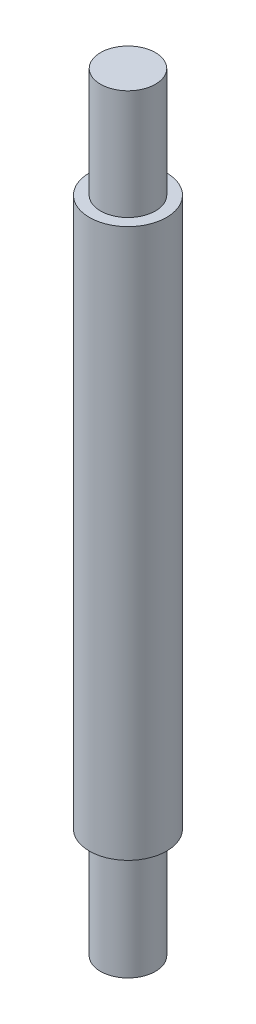
ISO-10303-21;
HEADER;
FILE_DESCRIPTION(('STEP AP214'),'2;1');
FILE_NAME('part.step','',(''),(''),'','','');
FILE_SCHEMA(('AUTOMOTIVE_DESIGN { 1 0 10303 214 1 1 1 1 }'));
ENDSEC;
DATA;
#1=APPLICATION_CONTEXT('core data for automotive mechanical design processes');
#2=APPLICATION_PROTOCOL_DEFINITION('international standard','automotive_design',2000,#1);
#3=PRODUCT_CONTEXT('',#1,'mechanical');
#4=PRODUCT('Part','Part','',(#3));
#5=PRODUCT_RELATED_PRODUCT_CATEGORY('part','',(#4));
#6=PRODUCT_DEFINITION_FORMATION('','',#4);
#7=PRODUCT_DEFINITION_CONTEXT('part definition',#1,'design');
#8=PRODUCT_DEFINITION('design','',#6,#7);
#9=PRODUCT_DEFINITION_SHAPE('','',#8);
#10=(LENGTH_UNIT() NAMED_UNIT(*) SI_UNIT(.MILLI.,.METRE.));
#11=(NAMED_UNIT(*) PLANE_ANGLE_UNIT() SI_UNIT($,.RADIAN.));
#12=(NAMED_UNIT(*) SI_UNIT($,.STERADIAN.) SOLID_ANGLE_UNIT());
#13=UNCERTAINTY_MEASURE_WITH_UNIT(LENGTH_MEASURE(1.E-05),#10,'distance_accuracy_value','');
#14=(GEOMETRIC_REPRESENTATION_CONTEXT(3) GLOBAL_UNCERTAINTY_ASSIGNED_CONTEXT((#13)) GLOBAL_UNIT_ASSIGNED_CONTEXT((#10,
#11,#12)) REPRESENTATION_CONTEXT('',''));
#15=CARTESIAN_POINT('',(0.,0.,0.));
#16=DIRECTION('',(0.,0.,1.));
#17=DIRECTION('',(1.,0.,0.));
#18=AXIS2_PLACEMENT_3D('',#15,#16,#17);
#19=CARTESIAN_POINT('',(0.,50.,0.));
#20=DIRECTION('',(0.,-1.,0.));
#21=DIRECTION('',(0.,0.,-1.));
#22=AXIS2_PLACEMENT_3D('',#19,#20,#21);
#23=CYLINDRICAL_SURFACE('',#22,3.515);
#24=CARTESIAN_POINT('',(0.,50.,0.));
#25=DIRECTION('',(0.,1.,0.));
#26=DIRECTION('',(0.,0.,1.));
#27=AXIS2_PLACEMENT_3D('',#24,#25,#26);
#28=CIRCLE('',#27,3.515);
#29=CARTESIAN_POINT('',(0.,50.,3.515));
#30=VERTEX_POINT('',#29);
#31=EDGE_CURVE('E10',#30,#30,#28,.T.);
#32=ORIENTED_EDGE('',*,*,#31,.F.);
#33=EDGE_LOOP('',(#32));
#34=FACE_BOUND('',#33,.T.);
#35=CARTESIAN_POINT('',(0.,0.,0.));
#36=DIRECTION('',(0.,1.,0.));
#37=DIRECTION('',(0.,0.,1.));
#38=AXIS2_PLACEMENT_3D('',#35,#36,#37);
#39=CIRCLE('',#38,3.515);
#40=CARTESIAN_POINT('',(0.,0.,3.515));
#41=VERTEX_POINT('',#40);
#42=EDGE_CURVE('E38',#41,#41,#39,.T.);
#43=ORIENTED_EDGE('',*,*,#42,.T.);
#44=EDGE_LOOP('',(#43));
#45=FACE_BOUND('',#44,.T.);
#46=ADVANCED_FACE('F35',(#34,#45),#23,.T.);
#47=CARTESIAN_POINT('',(0.,50.,0.));
#48=DIRECTION('',(0.,1.,0.));
#49=DIRECTION('',(0.,0.,1.));
#50=AXIS2_PLACEMENT_3D('',#47,#48,#49);
#51=PLANE('',#50);
#52=CARTESIAN_POINT('',(0.,50.,0.));
#53=DIRECTION('',(0.,1.,0.));
#54=DIRECTION('',(0.,0.,1.));
#55=AXIS2_PLACEMENT_3D('',#52,#53,#54);
#56=CIRCLE('',#55,2.5);
#57=CARTESIAN_POINT('',(0.,50.,2.5));
#58=VERTEX_POINT('',#57);
#59=EDGE_CURVE('E50',#58,#58,#56,.F.);
#60=ORIENTED_EDGE('',*,*,#59,.T.);
#61=EDGE_LOOP('',(#60));
#62=FACE_BOUND('',#61,.T.);
#63=ORIENTED_EDGE('',*,*,#31,.T.);
#64=EDGE_LOOP('',(#63));
#65=FACE_BOUND('',#64,.T.);
#66=ADVANCED_FACE('F76',(#62,#65),#51,.T.);
#67=CARTESIAN_POINT('',(0.,0.,0.));
#68=DIRECTION('',(0.,1.,0.));
#69=DIRECTION('',(0.,0.,1.));
#70=AXIS2_PLACEMENT_3D('',#67,#68,#69);
#71=PLANE('',#70);
#72=CARTESIAN_POINT('',(0.,0.,0.));
#73=DIRECTION('',(0.,1.,0.));
#74=DIRECTION('',(0.,0.,1.));
#75=AXIS2_PLACEMENT_3D('',#72,#73,#74);
#76=CIRCLE('',#75,2.5);
#77=CARTESIAN_POINT('',(0.,0.,2.5));
#78=VERTEX_POINT('',#77);
#79=EDGE_CURVE('E47',#78,#78,#76,.T.);
#80=ORIENTED_EDGE('',*,*,#79,.T.);
#81=EDGE_LOOP('',(#80));
#82=FACE_BOUND('',#81,.T.);
#83=ORIENTED_EDGE('',*,*,#42,.F.);
#84=EDGE_LOOP('',(#83));
#85=FACE_BOUND('',#84,.T.);
#86=ADVANCED_FACE('F81',(#82,#85),#71,.F.);
#87=CARTESIAN_POINT('',(0.,-10.,0.));
#88=DIRECTION('',(0.,1.,0.));
#89=DIRECTION('',(0.,0.,1.));
#90=AXIS2_PLACEMENT_3D('',#87,#88,#89);
#91=CYLINDRICAL_SURFACE('',#90,2.5);
#92=CARTESIAN_POINT('',(0.,-10.,0.));
#93=DIRECTION('',(0.,1.,0.));
#94=DIRECTION('',(0.,0.,1.));
#95=AXIS2_PLACEMENT_3D('',#92,#93,#94);
#96=CIRCLE('',#95,2.5);
#97=CARTESIAN_POINT('',(0.,-10.,2.5));
#98=VERTEX_POINT('',#97);
#99=EDGE_CURVE('E45',#98,#98,#96,.T.);
#100=ORIENTED_EDGE('',*,*,#99,.T.);
#101=EDGE_LOOP('',(#100));
#102=FACE_BOUND('',#101,.T.);
#103=ORIENTED_EDGE('',*,*,#79,.F.);
#104=EDGE_LOOP('',(#103));
#105=FACE_BOUND('',#104,.T.);
#106=ADVANCED_FACE('F71',(#102,#105),#91,.T.);
#107=CARTESIAN_POINT('',(0.,-10.,0.));
#108=DIRECTION('',(0.,1.,0.));
#109=DIRECTION('',(0.,0.,1.));
#110=AXIS2_PLACEMENT_3D('',#107,#108,#109);
#111=PLANE('',#110);
#112=ORIENTED_EDGE('',*,*,#99,.F.);
#113=EDGE_LOOP('',(#112));
#114=FACE_BOUND('',#113,.T.);
#115=ADVANCED_FACE('F63',(#114),#111,.F.);
#116=CARTESIAN_POINT('',(0.,60.,0.));
#117=DIRECTION('',(0.,-1.,0.));
#118=DIRECTION('',(0.,0.,-1.));
#119=AXIS2_PLACEMENT_3D('',#116,#117,#118);
#120=CYLINDRICAL_SURFACE('',#119,2.5);
#121=ORIENTED_EDGE('',*,*,#59,.F.);
#122=EDGE_LOOP('',(#121));
#123=FACE_BOUND('',#122,.T.);
#124=CARTESIAN_POINT('',(0.,60.,0.));
#125=DIRECTION('',(0.,1.,0.));
#126=DIRECTION('',(0.,0.,1.));
#127=AXIS2_PLACEMENT_3D('',#124,#125,#126);
#128=CIRCLE('',#127,2.5);
#129=CARTESIAN_POINT('',(0.,60.,2.5));
#130=VERTEX_POINT('',#129);
#131=EDGE_CURVE('E55',#130,#130,#128,.T.);
#132=ORIENTED_EDGE('',*,*,#131,.F.);
#133=EDGE_LOOP('',(#132));
#134=FACE_BOUND('',#133,.T.);
#135=ADVANCED_FACE('F61',(#123,#134),#120,.T.);
#136=CARTESIAN_POINT('',(0.,60.,0.));
#137=DIRECTION('',(0.,1.,0.));
#138=DIRECTION('',(0.,0.,1.));
#139=AXIS2_PLACEMENT_3D('',#136,#137,#138);
#140=PLANE('',#139);
#141=ORIENTED_EDGE('',*,*,#131,.T.);
#142=EDGE_LOOP('',(#141));
#143=FACE_BOUND('',#142,.T.);
#144=ADVANCED_FACE('F59',(#143),#140,.T.);
#145=CLOSED_SHELL('',(#46,#66,#86,#106,#115,#135,#144));
#146=MANIFOLD_SOLID_BREP('B2',#145);
#147=ADVANCED_BREP_SHAPE_REPRESENTATION('',(#18,#146),#14);
#148=SHAPE_DEFINITION_REPRESENTATION(#9,#147);
ENDSEC;
END-ISO-10303-21;
